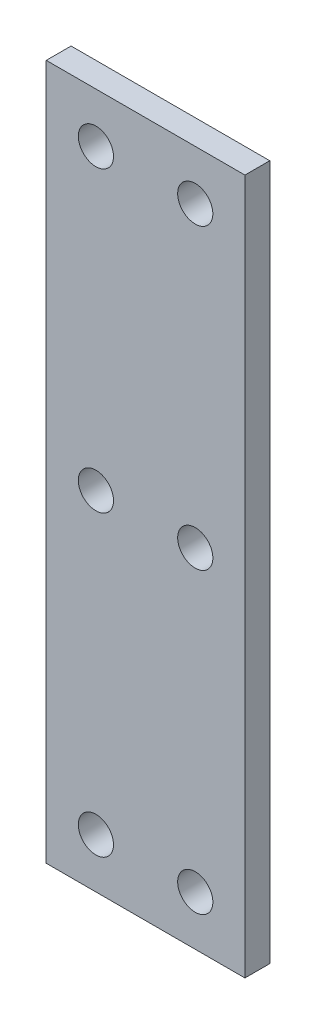
ISO-10303-21;
HEADER;
FILE_DESCRIPTION(('STEP AP214'),'2;1');
FILE_NAME('part.step','',(''),(''),'','','');
FILE_SCHEMA(('AUTOMOTIVE_DESIGN { 1 0 10303 214 1 1 1 1 }'));
ENDSEC;
DATA;
#1=APPLICATION_CONTEXT('core data for automotive mechanical design processes');
#2=APPLICATION_PROTOCOL_DEFINITION('international standard','automotive_design',2000,#1);
#3=PRODUCT_CONTEXT('',#1,'mechanical');
#4=PRODUCT('Part','Part','',(#3));
#5=PRODUCT_RELATED_PRODUCT_CATEGORY('part','',(#4));
#6=PRODUCT_DEFINITION_FORMATION('','',#4);
#7=PRODUCT_DEFINITION_CONTEXT('part definition',#1,'design');
#8=PRODUCT_DEFINITION('design','',#6,#7);
#9=PRODUCT_DEFINITION_SHAPE('','',#8);
#10=(LENGTH_UNIT() NAMED_UNIT(*) SI_UNIT(.MILLI.,.METRE.));
#11=(NAMED_UNIT(*) PLANE_ANGLE_UNIT() SI_UNIT($,.RADIAN.));
#12=(NAMED_UNIT(*) SI_UNIT($,.STERADIAN.) SOLID_ANGLE_UNIT());
#13=UNCERTAINTY_MEASURE_WITH_UNIT(LENGTH_MEASURE(1.E-05),#10,'distance_accuracy_value','');
#14=(GEOMETRIC_REPRESENTATION_CONTEXT(3) GLOBAL_UNCERTAINTY_ASSIGNED_CONTEXT((#13)) GLOBAL_UNIT_ASSIGNED_CONTEXT((#10,
#11,#12)) REPRESENTATION_CONTEXT('',''));
#15=CARTESIAN_POINT('',(0.,0.,0.));
#16=DIRECTION('',(0.,0.,1.));
#17=DIRECTION('',(1.,0.,0.));
#18=AXIS2_PLACEMENT_3D('',#15,#16,#17);
#19=CARTESIAN_POINT('',(0.,0.,3.175));
#20=DIRECTION('',(0.,0.,-1.));
#21=DIRECTION('',(-1.,0.,0.));
#22=AXIS2_PLACEMENT_3D('',#19,#20,#21);
#23=PLANE('',#22);
#24=DIRECTION('',(0.,1.,0.));
#25=VECTOR('',#24,1.);
#26=CARTESIAN_POINT('',(12.7,-44.45,3.175));
#27=LINE('',#26,#25);
#28=CARTESIAN_POINT('',(12.7,-44.45,3.175));
#29=VERTEX_POINT('',#28);
#30=CARTESIAN_POINT('',(12.7,44.45,3.175));
#31=VERTEX_POINT('',#30);
#32=EDGE_CURVE('E96',#29,#31,#27,.T.);
#33=ORIENTED_EDGE('',*,*,#32,.T.);
#34=DIRECTION('',(-1.,0.,0.));
#35=VECTOR('',#34,1.);
#36=CARTESIAN_POINT('',(-12.7,44.45,3.175));
#37=LINE('',#36,#35);
#38=CARTESIAN_POINT('',(-12.7,44.45,3.175));
#39=VERTEX_POINT('',#38);
#40=EDGE_CURVE('E91',#31,#39,#37,.T.);
#41=ORIENTED_EDGE('',*,*,#40,.T.);
#42=DIRECTION('',(0.,-1.,0.));
#43=VECTOR('',#42,1.);
#44=CARTESIAN_POINT('',(-12.7,-44.45,3.175));
#45=LINE('',#44,#43);
#46=CARTESIAN_POINT('',(-12.7,-44.45,3.175));
#47=VERTEX_POINT('',#46);
#48=EDGE_CURVE('E94',#39,#47,#45,.T.);
#49=ORIENTED_EDGE('',*,*,#48,.T.);
#50=DIRECTION('',(1.,0.,0.));
#51=VECTOR('',#50,1.);
#52=CARTESIAN_POINT('',(-12.7,-44.45,3.175));
#53=LINE('',#52,#51);
#54=EDGE_CURVE('E61',#47,#29,#53,.T.);
#55=ORIENTED_EDGE('',*,*,#54,.T.);
#56=EDGE_LOOP('',(#33,#41,#49,#55));
#57=FACE_BOUND('',#56,.T.);
#58=CARTESIAN_POINT('',(-6.35,38.1,3.175));
#59=DIRECTION('',(0.,0.,1.));
#60=DIRECTION('',(1.,0.,0.));
#61=AXIS2_PLACEMENT_3D('',#58,#59,#60);
#62=CIRCLE('',#61,2.25);
#63=CARTESIAN_POINT('',(-4.1,38.1,3.175));
#64=VERTEX_POINT('',#63);
#65=EDGE_CURVE('E116',#64,#64,#62,.T.);
#66=ORIENTED_EDGE('',*,*,#65,.F.);
#67=EDGE_LOOP('',(#66));
#68=FACE_BOUND('',#67,.T.);
#69=CARTESIAN_POINT('',(-6.35,0.,3.175));
#70=DIRECTION('',(0.,0.,1.));
#71=DIRECTION('',(1.,0.,0.));
#72=AXIS2_PLACEMENT_3D('',#69,#70,#71);
#73=CIRCLE('',#72,2.25);
#74=CARTESIAN_POINT('',(-4.1,0.,3.175));
#75=VERTEX_POINT('',#74);
#76=EDGE_CURVE('E138',#75,#75,#73,.T.);
#77=ORIENTED_EDGE('',*,*,#76,.F.);
#78=EDGE_LOOP('',(#77));
#79=FACE_BOUND('',#78,.T.);
#80=CARTESIAN_POINT('',(-6.34999999999999,-38.1,3.175));
#81=DIRECTION('',(0.,0.,1.));
#82=DIRECTION('',(1.,0.,0.));
#83=AXIS2_PLACEMENT_3D('',#80,#81,#82);
#84=CIRCLE('',#83,2.25);
#85=CARTESIAN_POINT('',(-4.09999999999999,-38.1,3.175));
#86=VERTEX_POINT('',#85);
#87=EDGE_CURVE('E146',#86,#86,#84,.T.);
#88=ORIENTED_EDGE('',*,*,#87,.F.);
#89=EDGE_LOOP('',(#88));
#90=FACE_BOUND('',#89,.T.);
#91=CARTESIAN_POINT('',(6.34999999999999,-38.1,3.175));
#92=DIRECTION('',(0.,0.,1.));
#93=DIRECTION('',(-1.,0.,0.));
#94=AXIS2_PLACEMENT_3D('',#91,#92,#93);
#95=CIRCLE('',#94,2.25);
#96=CARTESIAN_POINT('',(4.09999999999999,-38.1,3.175));
#97=VERTEX_POINT('',#96);
#98=EDGE_CURVE('E154',#97,#97,#95,.T.);
#99=ORIENTED_EDGE('',*,*,#98,.F.);
#100=EDGE_LOOP('',(#99));
#101=FACE_BOUND('',#100,.T.);
#102=CARTESIAN_POINT('',(6.34999999999999,0.,3.175));
#103=DIRECTION('',(0.,0.,1.));
#104=DIRECTION('',(-1.,0.,0.));
#105=AXIS2_PLACEMENT_3D('',#102,#103,#104);
#106=CIRCLE('',#105,2.25);
#107=CARTESIAN_POINT('',(4.09999999999999,0.,3.175));
#108=VERTEX_POINT('',#107);
#109=EDGE_CURVE('E162',#108,#108,#106,.T.);
#110=ORIENTED_EDGE('',*,*,#109,.F.);
#111=EDGE_LOOP('',(#110));
#112=FACE_BOUND('',#111,.T.);
#113=CARTESIAN_POINT('',(6.34999999999999,38.1,3.175));
#114=DIRECTION('',(0.,0.,1.));
#115=DIRECTION('',(-1.,0.,0.));
#116=AXIS2_PLACEMENT_3D('',#113,#114,#115);
#117=CIRCLE('',#116,2.25);
#118=CARTESIAN_POINT('',(4.09999999999999,38.1,3.175));
#119=VERTEX_POINT('',#118);
#120=EDGE_CURVE('E170',#119,#119,#117,.T.);
#121=ORIENTED_EDGE('',*,*,#120,.F.);
#122=EDGE_LOOP('',(#121));
#123=FACE_BOUND('',#122,.T.);
#124=ADVANCED_FACE('F43',(#57,#68,#79,#90,#101,#112,#123),#23,.F.);
#125=CARTESIAN_POINT('',(0.,0.,0.));
#126=DIRECTION('',(0.,0.,-1.));
#127=DIRECTION('',(-1.,0.,0.));
#128=AXIS2_PLACEMENT_3D('',#125,#126,#127);
#129=PLANE('',#128);
#130=CARTESIAN_POINT('',(6.34999999999999,0.,0.));
#131=DIRECTION('',(0.,0.,1.));
#132=DIRECTION('',(-1.,0.,0.));
#133=AXIS2_PLACEMENT_3D('',#130,#131,#132);
#134=CIRCLE('',#133,2.25);
#135=CARTESIAN_POINT('',(4.09999999999999,0.,0.));
#136=VERTEX_POINT('',#135);
#137=EDGE_CURVE('E166',#136,#136,#134,.T.);
#138=ORIENTED_EDGE('',*,*,#137,.T.);
#139=EDGE_LOOP('',(#138));
#140=FACE_BOUND('',#139,.T.);
#141=CARTESIAN_POINT('',(-6.34999999999999,-38.1,0.));
#142=DIRECTION('',(0.,0.,1.));
#143=DIRECTION('',(1.,0.,0.));
#144=AXIS2_PLACEMENT_3D('',#141,#142,#143);
#145=CIRCLE('',#144,2.25);
#146=CARTESIAN_POINT('',(-4.09999999999999,-38.1,0.));
#147=VERTEX_POINT('',#146);
#148=EDGE_CURVE('E150',#147,#147,#145,.T.);
#149=ORIENTED_EDGE('',*,*,#148,.T.);
#150=EDGE_LOOP('',(#149));
#151=FACE_BOUND('',#150,.T.);
#152=CARTESIAN_POINT('',(-6.35,38.1,0.));
#153=DIRECTION('',(0.,0.,1.));
#154=DIRECTION('',(1.,0.,0.));
#155=AXIS2_PLACEMENT_3D('',#152,#153,#154);
#156=CIRCLE('',#155,2.25);
#157=CARTESIAN_POINT('',(-4.1,38.1,0.));
#158=VERTEX_POINT('',#157);
#159=EDGE_CURVE('E134',#158,#158,#156,.T.);
#160=ORIENTED_EDGE('',*,*,#159,.T.);
#161=EDGE_LOOP('',(#160));
#162=FACE_BOUND('',#161,.T.);
#163=DIRECTION('',(0.,1.,0.));
#164=VECTOR('',#163,1.);
#165=CARTESIAN_POINT('',(12.7,-44.45,0.));
#166=LINE('',#165,#164);
#167=CARTESIAN_POINT('',(12.7,-44.45,0.));
#168=VERTEX_POINT('',#167);
#169=CARTESIAN_POINT('',(12.7,44.45,0.));
#170=VERTEX_POINT('',#169);
#171=EDGE_CURVE('E112',#168,#170,#166,.T.);
#172=ORIENTED_EDGE('',*,*,#171,.F.);
#173=DIRECTION('',(1.,0.,0.));
#174=VECTOR('',#173,1.);
#175=CARTESIAN_POINT('',(-12.7,-44.45,0.));
#176=LINE('',#175,#174);
#177=CARTESIAN_POINT('',(-12.7,-44.45,0.));
#178=VERTEX_POINT('',#177);
#179=EDGE_CURVE('E84',#178,#168,#176,.T.);
#180=ORIENTED_EDGE('',*,*,#179,.F.);
#181=DIRECTION('',(0.,-1.,0.));
#182=VECTOR('',#181,1.);
#183=CARTESIAN_POINT('',(-12.7,-44.45,0.));
#184=LINE('',#183,#182);
#185=CARTESIAN_POINT('',(-12.7,44.45,0.));
#186=VERTEX_POINT('',#185);
#187=EDGE_CURVE('E78',#186,#178,#184,.T.);
#188=ORIENTED_EDGE('',*,*,#187,.F.);
#189=DIRECTION('',(-1.,0.,0.));
#190=VECTOR('',#189,1.);
#191=CARTESIAN_POINT('',(-12.7,44.45,0.));
#192=LINE('',#191,#190);
#193=EDGE_CURVE('E101',#170,#186,#192,.T.);
#194=ORIENTED_EDGE('',*,*,#193,.F.);
#195=EDGE_LOOP('',(#172,#180,#188,#194));
#196=FACE_BOUND('',#195,.T.);
#197=CARTESIAN_POINT('',(-6.35,0.,0.));
#198=DIRECTION('',(0.,0.,1.));
#199=DIRECTION('',(1.,0.,0.));
#200=AXIS2_PLACEMENT_3D('',#197,#198,#199);
#201=CIRCLE('',#200,2.25);
#202=CARTESIAN_POINT('',(-4.1,0.,0.));
#203=VERTEX_POINT('',#202);
#204=EDGE_CURVE('E142',#203,#203,#201,.T.);
#205=ORIENTED_EDGE('',*,*,#204,.T.);
#206=EDGE_LOOP('',(#205));
#207=FACE_BOUND('',#206,.T.);
#208=CARTESIAN_POINT('',(6.34999999999999,-38.1,0.));
#209=DIRECTION('',(0.,0.,1.));
#210=DIRECTION('',(-1.,0.,0.));
#211=AXIS2_PLACEMENT_3D('',#208,#209,#210);
#212=CIRCLE('',#211,2.25);
#213=CARTESIAN_POINT('',(4.09999999999999,-38.1,0.));
#214=VERTEX_POINT('',#213);
#215=EDGE_CURVE('E158',#214,#214,#212,.T.);
#216=ORIENTED_EDGE('',*,*,#215,.T.);
#217=EDGE_LOOP('',(#216));
#218=FACE_BOUND('',#217,.T.);
#219=CARTESIAN_POINT('',(6.34999999999999,38.1,0.));
#220=DIRECTION('',(0.,0.,1.));
#221=DIRECTION('',(-1.,0.,0.));
#222=AXIS2_PLACEMENT_3D('',#219,#220,#221);
#223=CIRCLE('',#222,2.25);
#224=CARTESIAN_POINT('',(4.09999999999999,38.1,0.));
#225=VERTEX_POINT('',#224);
#226=EDGE_CURVE('E174',#225,#225,#223,.T.);
#227=ORIENTED_EDGE('',*,*,#226,.T.);
#228=EDGE_LOOP('',(#227));
#229=FACE_BOUND('',#228,.T.);
#230=ADVANCED_FACE('F129',(#140,#151,#162,#196,#207,#218,#229),#129,.T.);
#231=CARTESIAN_POINT('',(12.7,-44.45,3.175));
#232=DIRECTION('',(-1.,0.,0.));
#233=DIRECTION('',(0.,0.,1.));
#234=AXIS2_PLACEMENT_3D('',#231,#232,#233);
#235=PLANE('',#234);
#236=ORIENTED_EDGE('',*,*,#171,.T.);
#237=DIRECTION('',(0.,0.,-1.));
#238=VECTOR('',#237,1.);
#239=CARTESIAN_POINT('',(12.7,44.45,3.175));
#240=LINE('',#239,#238);
#241=EDGE_CURVE('E11',#31,#170,#240,.T.);
#242=ORIENTED_EDGE('',*,*,#241,.F.);
#243=ORIENTED_EDGE('',*,*,#32,.F.);
#244=DIRECTION('',(0.,0.,-1.));
#245=VECTOR('',#244,1.);
#246=CARTESIAN_POINT('',(12.7,-44.45,3.175));
#247=LINE('',#246,#245);
#248=EDGE_CURVE('E108',#29,#168,#247,.T.);
#249=ORIENTED_EDGE('',*,*,#248,.T.);
#250=EDGE_LOOP('',(#236,#242,#243,#249));
#251=FACE_BOUND('',#250,.T.);
#252=ADVANCED_FACE('F45',(#251),#235,.F.);
#253=CARTESIAN_POINT('',(-12.7,44.45,3.175));
#254=DIRECTION('',(0.,-1.,0.));
#255=DIRECTION('',(0.,0.,-1.));
#256=AXIS2_PLACEMENT_3D('',#253,#254,#255);
#257=PLANE('',#256);
#258=ORIENTED_EDGE('',*,*,#193,.T.);
#259=DIRECTION('',(0.,0.,-1.));
#260=VECTOR('',#259,1.);
#261=CARTESIAN_POINT('',(-12.7,44.45,3.175));
#262=LINE('',#261,#260);
#263=EDGE_CURVE('E53',#39,#186,#262,.T.);
#264=ORIENTED_EDGE('',*,*,#263,.F.);
#265=ORIENTED_EDGE('',*,*,#40,.F.);
#266=ORIENTED_EDGE('',*,*,#241,.T.);
#267=EDGE_LOOP('',(#258,#264,#265,#266));
#268=FACE_BOUND('',#267,.T.);
#269=ADVANCED_FACE('F100',(#268),#257,.F.);
#270=CARTESIAN_POINT('',(-12.7,-44.45,3.175));
#271=DIRECTION('',(1.,0.,0.));
#272=DIRECTION('',(0.,0.,-1.));
#273=AXIS2_PLACEMENT_3D('',#270,#271,#272);
#274=PLANE('',#273);
#275=ORIENTED_EDGE('',*,*,#187,.T.);
#276=DIRECTION('',(0.,0.,-1.));
#277=VECTOR('',#276,1.);
#278=CARTESIAN_POINT('',(-12.7,-44.45,3.175));
#279=LINE('',#278,#277);
#280=EDGE_CURVE('E103',#47,#178,#279,.T.);
#281=ORIENTED_EDGE('',*,*,#280,.F.);
#282=ORIENTED_EDGE('',*,*,#48,.F.);
#283=ORIENTED_EDGE('',*,*,#263,.T.);
#284=EDGE_LOOP('',(#275,#281,#282,#283));
#285=FACE_BOUND('',#284,.T.);
#286=ADVANCED_FACE('F104',(#285),#274,.F.);
#287=CARTESIAN_POINT('',(-12.7,-44.45,3.175));
#288=DIRECTION('',(0.,1.,0.));
#289=DIRECTION('',(0.,0.,1.));
#290=AXIS2_PLACEMENT_3D('',#287,#288,#289);
#291=PLANE('',#290);
#292=ORIENTED_EDGE('',*,*,#179,.T.);
#293=ORIENTED_EDGE('',*,*,#248,.F.);
#294=ORIENTED_EDGE('',*,*,#54,.F.);
#295=ORIENTED_EDGE('',*,*,#280,.T.);
#296=EDGE_LOOP('',(#292,#293,#294,#295));
#297=FACE_BOUND('',#296,.T.);
#298=ADVANCED_FACE('F126',(#297),#291,.F.);
#299=CARTESIAN_POINT('',(-6.35,38.1,3.175));
#300=DIRECTION('',(0.,0.,-1.));
#301=DIRECTION('',(-1.,0.,0.));
#302=AXIS2_PLACEMENT_3D('',#299,#300,#301);
#303=CYLINDRICAL_SURFACE('',#302,2.25);
#304=ORIENTED_EDGE('',*,*,#65,.T.);
#305=EDGE_LOOP('',(#304));
#306=FACE_BOUND('',#305,.T.);
#307=ORIENTED_EDGE('',*,*,#159,.F.);
#308=EDGE_LOOP('',(#307));
#309=FACE_BOUND('',#308,.T.);
#310=ADVANCED_FACE('F193',(#306,#309),#303,.F.);
#311=CARTESIAN_POINT('',(-6.35,0.,3.175));
#312=DIRECTION('',(0.,0.,-1.));
#313=DIRECTION('',(-1.,0.,0.));
#314=AXIS2_PLACEMENT_3D('',#311,#312,#313);
#315=CYLINDRICAL_SURFACE('',#314,2.25);
#316=ORIENTED_EDGE('',*,*,#76,.T.);
#317=EDGE_LOOP('',(#316));
#318=FACE_BOUND('',#317,.T.);
#319=ORIENTED_EDGE('',*,*,#204,.F.);
#320=EDGE_LOOP('',(#319));
#321=FACE_BOUND('',#320,.T.);
#322=ADVANCED_FACE('F247',(#318,#321),#315,.F.);
#323=CARTESIAN_POINT('',(-6.34999999999999,-38.1,3.175));
#324=DIRECTION('',(0.,0.,-1.));
#325=DIRECTION('',(-1.,0.,0.));
#326=AXIS2_PLACEMENT_3D('',#323,#324,#325);
#327=CYLINDRICAL_SURFACE('',#326,2.25);
#328=ORIENTED_EDGE('',*,*,#87,.T.);
#329=EDGE_LOOP('',(#328));
#330=FACE_BOUND('',#329,.T.);
#331=ORIENTED_EDGE('',*,*,#148,.F.);
#332=EDGE_LOOP('',(#331));
#333=FACE_BOUND('',#332,.T.);
#334=ADVANCED_FACE('F256',(#330,#333),#327,.F.);
#335=CARTESIAN_POINT('',(6.34999999999999,-38.1,3.175));
#336=DIRECTION('',(0.,0.,-1.));
#337=DIRECTION('',(-1.,0.,0.));
#338=AXIS2_PLACEMENT_3D('',#335,#336,#337);
#339=CYLINDRICAL_SURFACE('',#338,2.25);
#340=ORIENTED_EDGE('',*,*,#98,.T.);
#341=EDGE_LOOP('',(#340));
#342=FACE_BOUND('',#341,.T.);
#343=ORIENTED_EDGE('',*,*,#215,.F.);
#344=EDGE_LOOP('',(#343));
#345=FACE_BOUND('',#344,.T.);
#346=ADVANCED_FACE('F265',(#342,#345),#339,.F.);
#347=CARTESIAN_POINT('',(6.34999999999999,0.,3.175));
#348=DIRECTION('',(0.,0.,-1.));
#349=DIRECTION('',(-1.,0.,0.));
#350=AXIS2_PLACEMENT_3D('',#347,#348,#349);
#351=CYLINDRICAL_SURFACE('',#350,2.25);
#352=ORIENTED_EDGE('',*,*,#109,.T.);
#353=EDGE_LOOP('',(#352));
#354=FACE_BOUND('',#353,.T.);
#355=ORIENTED_EDGE('',*,*,#137,.F.);
#356=EDGE_LOOP('',(#355));
#357=FACE_BOUND('',#356,.T.);
#358=ADVANCED_FACE('F275',(#354,#357),#351,.F.);
#359=CARTESIAN_POINT('',(6.34999999999999,38.1,3.175));
#360=DIRECTION('',(0.,0.,-1.));
#361=DIRECTION('',(-1.,0.,0.));
#362=AXIS2_PLACEMENT_3D('',#359,#360,#361);
#363=CYLINDRICAL_SURFACE('',#362,2.25);
#364=ORIENTED_EDGE('',*,*,#120,.T.);
#365=EDGE_LOOP('',(#364));
#366=FACE_BOUND('',#365,.T.);
#367=ORIENTED_EDGE('',*,*,#226,.F.);
#368=EDGE_LOOP('',(#367));
#369=FACE_BOUND('',#368,.T.);
#370=ADVANCED_FACE('F182',(#366,#369),#363,.F.);
#371=CLOSED_SHELL('',(#124,#230,#252,#269,#286,#298,#310,#322,#334,#346,#358,#370));
#372=MANIFOLD_SOLID_BREP('B2',#371);
#373=ADVANCED_BREP_SHAPE_REPRESENTATION('',(#18,#372),#14);
#374=SHAPE_DEFINITION_REPRESENTATION(#9,#373);
ENDSEC;
END-ISO-10303-21;
